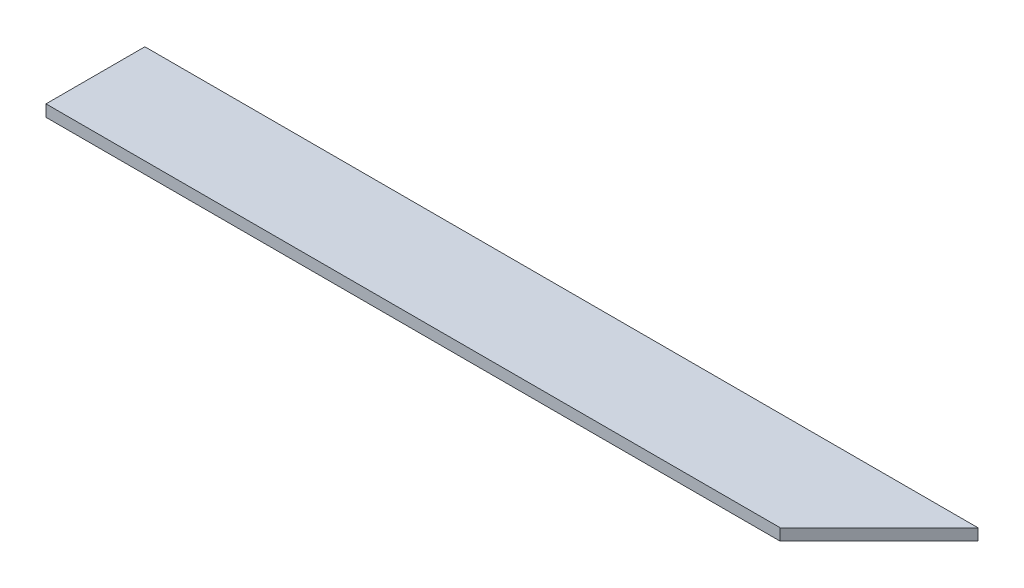
ISO-10303-21;
HEADER;
FILE_DESCRIPTION(('STEP AP214'),'2;1');
FILE_NAME('part.step','',(''),(''),'','','');
FILE_SCHEMA(('AUTOMOTIVE_DESIGN { 1 0 10303 214 1 1 1 1 }'));
ENDSEC;
DATA;
#1=APPLICATION_CONTEXT('core data for automotive mechanical design processes');
#2=APPLICATION_PROTOCOL_DEFINITION('international standard','automotive_design',2000,#1);
#3=PRODUCT_CONTEXT('',#1,'mechanical');
#4=PRODUCT('Part','Part','',(#3));
#5=PRODUCT_RELATED_PRODUCT_CATEGORY('part','',(#4));
#6=PRODUCT_DEFINITION_FORMATION('','',#4);
#7=PRODUCT_DEFINITION_CONTEXT('part definition',#1,'design');
#8=PRODUCT_DEFINITION('design','',#6,#7);
#9=PRODUCT_DEFINITION_SHAPE('','',#8);
#10=(LENGTH_UNIT() NAMED_UNIT(*) SI_UNIT(.MILLI.,.METRE.));
#11=(NAMED_UNIT(*) PLANE_ANGLE_UNIT() SI_UNIT($,.RADIAN.));
#12=(NAMED_UNIT(*) SI_UNIT($,.STERADIAN.) SOLID_ANGLE_UNIT());
#13=UNCERTAINTY_MEASURE_WITH_UNIT(LENGTH_MEASURE(1.E-05),#10,'distance_accuracy_value','');
#14=(GEOMETRIC_REPRESENTATION_CONTEXT(3) GLOBAL_UNCERTAINTY_ASSIGNED_CONTEXT((#13)) GLOBAL_UNIT_ASSIGNED_CONTEXT((#10,
#11,#12)) REPRESENTATION_CONTEXT('',''));
#15=CARTESIAN_POINT('',(0.,0.,0.));
#16=DIRECTION('',(0.,0.,1.));
#17=DIRECTION('',(1.,0.,0.));
#18=AXIS2_PLACEMENT_3D('',#15,#16,#17);
#19=CARTESIAN_POINT('',(-99.8700917986146,3.,-34.9210080852118));
#20=DIRECTION('',(1.,0.,0.));
#21=DIRECTION('',(0.,0.,-1.));
#22=AXIS2_PLACEMENT_3D('',#19,#20,#21);
#23=PLANE('',#22);
#24=DIRECTION('',(0.,0.,1.));
#25=VECTOR('',#24,1.);
#26=CARTESIAN_POINT('',(-99.8700917986146,0.,-34.9210080852118));
#27=LINE('',#26,#25);
#28=CARTESIAN_POINT('',(-99.8700917986146,0.,-34.9210080852118));
#29=VERTEX_POINT('',#28);
#30=CARTESIAN_POINT('',(-99.8700917986146,0.,-9.52100808521183));
#31=VERTEX_POINT('',#30);
#32=EDGE_CURVE('E84',#29,#31,#27,.T.);
#33=ORIENTED_EDGE('',*,*,#32,.T.);
#34=DIRECTION('',(0.,-1.,0.));
#35=VECTOR('',#34,1.);
#36=CARTESIAN_POINT('',(-99.8700917986146,3.,-9.52100808521183));
#37=LINE('',#36,#35);
#38=CARTESIAN_POINT('',(-99.8700917986146,3.,-9.52100808521183));
#39=VERTEX_POINT('',#38);
#40=EDGE_CURVE('E40',#39,#31,#37,.T.);
#41=ORIENTED_EDGE('',*,*,#40,.F.);
#42=DIRECTION('',(0.,0.,1.));
#43=VECTOR('',#42,1.);
#44=CARTESIAN_POINT('',(-99.8700917986146,3.,-34.9210080852118));
#45=LINE('',#44,#43);
#46=CARTESIAN_POINT('',(-99.8700917986146,3.,-34.9210080852118));
#47=VERTEX_POINT('',#46);
#48=EDGE_CURVE('E78',#47,#39,#45,.T.);
#49=ORIENTED_EDGE('',*,*,#48,.F.);
#50=DIRECTION('',(0.,-1.,0.));
#51=VECTOR('',#50,1.);
#52=CARTESIAN_POINT('',(-99.8700917986146,3.,-34.9210080852118));
#53=LINE('',#52,#51);
#54=EDGE_CURVE('E72',#47,#29,#53,.T.);
#55=ORIENTED_EDGE('',*,*,#54,.T.);
#56=EDGE_LOOP('',(#33,#41,#49,#55));
#57=FACE_BOUND('',#56,.T.);
#58=ADVANCED_FACE('F33',(#57),#23,.F.);
#59=CARTESIAN_POINT('',(-99.8700917986146,3.,-9.52100808521183));
#60=DIRECTION('',(0.,0.,-1.));
#61=DIRECTION('',(-1.,0.,0.));
#62=AXIS2_PLACEMENT_3D('',#59,#60,#61);
#63=PLANE('',#62);
#64=DIRECTION('',(1.,0.,0.));
#65=VECTOR('',#64,1.);
#66=CARTESIAN_POINT('',(-99.8700917986146,0.,-9.52100808521183));
#67=LINE('',#66,#65);
#68=CARTESIAN_POINT('',(88.7299082013859,0.,-9.52100808521183));
#69=VERTEX_POINT('',#68);
#70=EDGE_CURVE('E79',#31,#69,#67,.T.);
#71=ORIENTED_EDGE('',*,*,#70,.T.);
#72=DIRECTION('',(0.,1.,0.));
#73=VECTOR('',#72,1.);
#74=CARTESIAN_POINT('',(88.7299082013858,-7.,-9.52100808521182));
#75=LINE('',#74,#73);
#76=CARTESIAN_POINT('',(88.7299082013858,3.,-9.52100808521182));
#77=VERTEX_POINT('',#76);
#78=EDGE_CURVE('E47',#69,#77,#75,.T.);
#79=ORIENTED_EDGE('',*,*,#78,.T.);
#80=DIRECTION('',(1.,0.,0.));
#81=VECTOR('',#80,1.);
#82=CARTESIAN_POINT('',(-99.8700917986146,3.,-9.52100808521183));
#83=LINE('',#82,#81);
#84=EDGE_CURVE('E99',#39,#77,#83,.T.);
#85=ORIENTED_EDGE('',*,*,#84,.F.);
#86=ORIENTED_EDGE('',*,*,#40,.T.);
#87=EDGE_LOOP('',(#71,#79,#85,#86));
#88=FACE_BOUND('',#87,.T.);
#89=ADVANCED_FACE('F97',(#88),#63,.F.);
#90=CARTESIAN_POINT('',(-99.8700917986146,3.,-34.9210080852118));
#91=DIRECTION('',(0.,0.,1.));
#92=DIRECTION('',(1.,0.,0.));
#93=AXIS2_PLACEMENT_3D('',#90,#91,#92);
#94=PLANE('',#93);
#95=DIRECTION('',(-1.,0.,0.));
#96=VECTOR('',#95,1.);
#97=CARTESIAN_POINT('',(-99.8700917986146,0.,-34.9210080852118));
#98=LINE('',#97,#96);
#99=CARTESIAN_POINT('',(114.129908201385,0.,-34.9210080852118));
#100=VERTEX_POINT('',#99);
#101=EDGE_CURVE('E69',#100,#29,#98,.T.);
#102=ORIENTED_EDGE('',*,*,#101,.T.);
#103=ORIENTED_EDGE('',*,*,#54,.F.);
#104=DIRECTION('',(-1.,0.,0.));
#105=VECTOR('',#104,1.);
#106=CARTESIAN_POINT('',(-99.8700917986146,3.,-34.9210080852118));
#107=LINE('',#106,#105);
#108=CARTESIAN_POINT('',(114.129908201385,3.,-34.9210080852118));
#109=VERTEX_POINT('',#108);
#110=EDGE_CURVE('E55',#109,#47,#107,.T.);
#111=ORIENTED_EDGE('',*,*,#110,.F.);
#112=DIRECTION('',(0.,-1.,0.));
#113=VECTOR('',#112,1.);
#114=CARTESIAN_POINT('',(114.129908201385,3.,-34.9210080852118));
#115=LINE('',#114,#113);
#116=EDGE_CURVE('E75',#109,#100,#115,.T.);
#117=ORIENTED_EDGE('',*,*,#116,.T.);
#118=EDGE_LOOP('',(#102,#103,#111,#117));
#119=FACE_BOUND('',#118,.T.);
#120=ADVANCED_FACE('F71',(#119),#94,.F.);
#121=CARTESIAN_POINT('',(0.,3.,0.));
#122=DIRECTION('',(0.,1.,0.));
#123=DIRECTION('',(0.,0.,1.));
#124=AXIS2_PLACEMENT_3D('',#121,#122,#123);
#125=PLANE('',#124);
#126=DIRECTION('',(-0.707106781186541,0.,0.707106781186554));
#127=VECTOR('',#126,1.);
#128=CARTESIAN_POINT('',(114.129908201385,3.,-34.9210080852118));
#129=LINE('',#128,#127);
#130=EDGE_CURVE('E91',#109,#77,#129,.T.);
#131=ORIENTED_EDGE('',*,*,#130,.F.);
#132=ORIENTED_EDGE('',*,*,#110,.T.);
#133=ORIENTED_EDGE('',*,*,#48,.T.);
#134=ORIENTED_EDGE('',*,*,#84,.T.);
#135=EDGE_LOOP('',(#131,#132,#133,#134));
#136=FACE_BOUND('',#135,.T.);
#137=ADVANCED_FACE('F101',(#136),#125,.T.);
#138=CARTESIAN_POINT('',(0.,0.,0.));
#139=DIRECTION('',(0.,1.,0.));
#140=DIRECTION('',(0.,0.,1.));
#141=AXIS2_PLACEMENT_3D('',#138,#139,#140);
#142=PLANE('',#141);
#143=ORIENTED_EDGE('',*,*,#101,.F.);
#144=DIRECTION('',(-0.707106781186541,0.,0.707106781186554));
#145=VECTOR('',#144,1.);
#146=CARTESIAN_POINT('',(39.6044500580878,0.,39.6044500580871));
#147=LINE('',#146,#145);
#148=EDGE_CURVE('E11',#100,#69,#147,.T.);
#149=ORIENTED_EDGE('',*,*,#148,.T.);
#150=ORIENTED_EDGE('',*,*,#70,.F.);
#151=ORIENTED_EDGE('',*,*,#32,.F.);
#152=EDGE_LOOP('',(#143,#149,#150,#151));
#153=FACE_BOUND('',#152,.T.);
#154=ADVANCED_FACE('F86',(#153),#142,.F.);
#155=CARTESIAN_POINT('',(114.129908201385,-7.,-34.9210080852118));
#156=DIRECTION('',(-0.707106781186554,0.,-0.707106781186541));
#157=DIRECTION('',(-0.707106781186541,0.,0.707106781186554));
#158=AXIS2_PLACEMENT_3D('',#155,#156,#157);
#159=PLANE('',#158);
#160=ORIENTED_EDGE('',*,*,#116,.F.);
#161=ORIENTED_EDGE('',*,*,#130,.T.);
#162=ORIENTED_EDGE('',*,*,#78,.F.);
#163=ORIENTED_EDGE('',*,*,#148,.F.);
#164=EDGE_LOOP('',(#160,#161,#162,#163));
#165=FACE_BOUND('',#164,.T.);
#166=ADVANCED_FACE('F104',(#165),#159,.F.);
#167=CLOSED_SHELL('',(#58,#89,#120,#137,#154,#166));
#168=MANIFOLD_SOLID_BREP('B2',#167);
#169=ADVANCED_BREP_SHAPE_REPRESENTATION('',(#18,#168),#14);
#170=SHAPE_DEFINITION_REPRESENTATION(#9,#169);
ENDSEC;
END-ISO-10303-21;
